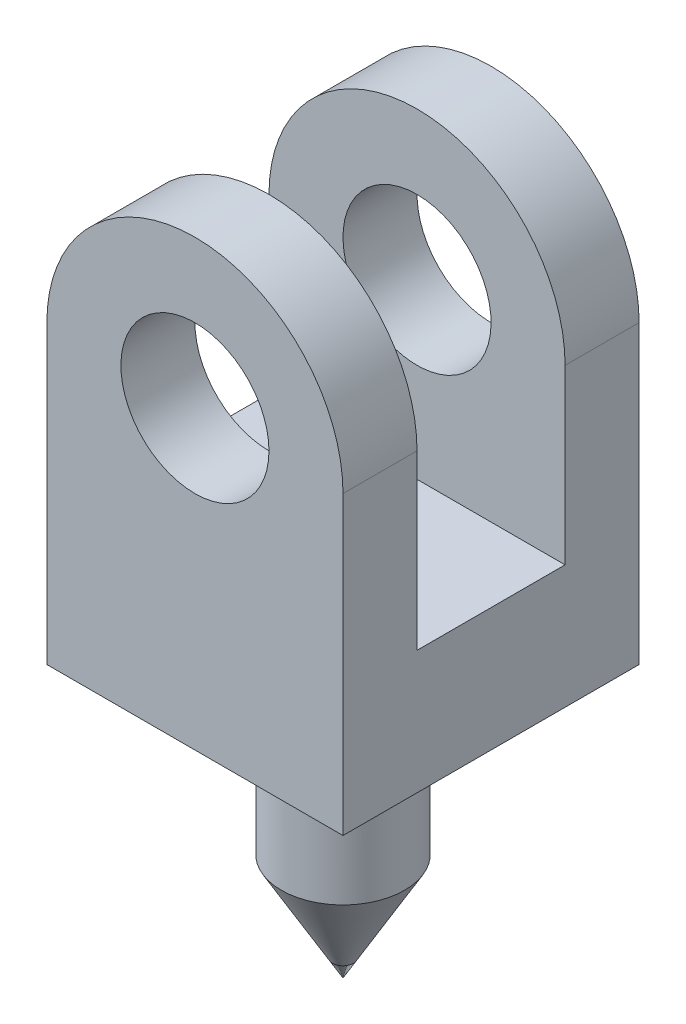
ISO-10303-21;
HEADER;
FILE_DESCRIPTION(('STEP AP214'),'2;1');
FILE_NAME('part.step','',(''),(''),'','','');
FILE_SCHEMA(('AUTOMOTIVE_DESIGN { 1 0 10303 214 1 1 1 1 }'));
ENDSEC;
DATA;
#1=APPLICATION_CONTEXT('core data for automotive mechanical design processes');
#2=APPLICATION_PROTOCOL_DEFINITION('international standard','automotive_design',2000,#1);
#3=PRODUCT_CONTEXT('',#1,'mechanical');
#4=PRODUCT('Part','Part','',(#3));
#5=PRODUCT_RELATED_PRODUCT_CATEGORY('part','',(#4));
#6=PRODUCT_DEFINITION_FORMATION('','',#4);
#7=PRODUCT_DEFINITION_CONTEXT('part definition',#1,'design');
#8=PRODUCT_DEFINITION('design','',#6,#7);
#9=PRODUCT_DEFINITION_SHAPE('','',#8);
#10=(LENGTH_UNIT() NAMED_UNIT(*) SI_UNIT(.MILLI.,.METRE.));
#11=(NAMED_UNIT(*) PLANE_ANGLE_UNIT() SI_UNIT($,.RADIAN.));
#12=(NAMED_UNIT(*) SI_UNIT($,.STERADIAN.) SOLID_ANGLE_UNIT());
#13=UNCERTAINTY_MEASURE_WITH_UNIT(LENGTH_MEASURE(1.E-05),#10,'distance_accuracy_value','');
#14=(GEOMETRIC_REPRESENTATION_CONTEXT(3) GLOBAL_UNCERTAINTY_ASSIGNED_CONTEXT((#13)) GLOBAL_UNIT_ASSIGNED_CONTEXT((#10,
#11,#12)) REPRESENTATION_CONTEXT('',''));
#15=CARTESIAN_POINT('',(0.,0.,0.));
#16=DIRECTION('',(0.,0.,1.));
#17=DIRECTION('',(1.,0.,0.));
#18=AXIS2_PLACEMENT_3D('',#15,#16,#17);
#19=CARTESIAN_POINT('',(0.,0.,12.));
#20=DIRECTION('',(0.,0.,-1.));
#21=DIRECTION('',(-1.,0.,0.));
#22=AXIS2_PLACEMENT_3D('',#19,#20,#21);
#23=CYLINDRICAL_SURFACE('',#22,12.);
#24=DIRECTION('',(0.,0.,-1.));
#25=VECTOR('',#24,1.);
#26=CARTESIAN_POINT('',(12.,0.,12.));
#27=LINE('',#26,#25);
#28=CARTESIAN_POINT('',(12.,0.,12.));
#29=VERTEX_POINT('',#28);
#30=CARTESIAN_POINT('',(12.,0.,6.));
#31=VERTEX_POINT('',#30);
#32=EDGE_CURVE('E156',#29,#31,#27,.T.);
#33=ORIENTED_EDGE('',*,*,#32,.T.);
#34=CARTESIAN_POINT('',(0.,0.,6.));
#35=DIRECTION('',(0.,0.,1.));
#36=DIRECTION('',(0.,-1.,0.));
#37=AXIS2_PLACEMENT_3D('',#34,#35,#36);
#38=CIRCLE('',#37,12.);
#39=CARTESIAN_POINT('',(-12.,0.,6.));
#40=VERTEX_POINT('',#39);
#41=EDGE_CURVE('E209',#31,#40,#38,.T.);
#42=ORIENTED_EDGE('',*,*,#41,.T.);
#43=DIRECTION('',(0.,0.,-1.));
#44=VECTOR('',#43,1.);
#45=CARTESIAN_POINT('',(-12.,0.,12.));
#46=LINE('',#45,#44);
#47=CARTESIAN_POINT('',(-12.,0.,12.));
#48=VERTEX_POINT('',#47);
#49=EDGE_CURVE('E12',#48,#40,#46,.T.);
#50=ORIENTED_EDGE('',*,*,#49,.F.);
#51=CARTESIAN_POINT('',(0.,0.,12.));
#52=DIRECTION('',(0.,0.,1.));
#53=DIRECTION('',(1.,0.,0.));
#54=AXIS2_PLACEMENT_3D('',#51,#52,#53);
#55=CIRCLE('',#54,12.);
#56=EDGE_CURVE('E144',#29,#48,#55,.T.);
#57=ORIENTED_EDGE('',*,*,#56,.F.);
#58=EDGE_LOOP('',(#33,#42,#50,#57));
#59=FACE_BOUND('',#58,.T.);
#60=ADVANCED_FACE('F65',(#59),#23,.T.);
#61=CARTESIAN_POINT('',(0.,0.,12.));
#62=DIRECTION('',(0.,0.,-1.));
#63=DIRECTION('',(-1.,0.,0.));
#64=AXIS2_PLACEMENT_3D('',#61,#62,#63);
#65=CYLINDRICAL_SURFACE('',#64,6.);
#66=CARTESIAN_POINT('',(0.,0.,6.));
#67=DIRECTION('',(0.,0.,1.));
#68=DIRECTION('',(0.,-1.,0.));
#69=AXIS2_PLACEMENT_3D('',#66,#67,#68);
#70=CIRCLE('',#69,6.);
#71=CARTESIAN_POINT('',(0.,-6.,6.));
#72=VERTEX_POINT('',#71);
#73=EDGE_CURVE('E69',#72,#72,#70,.T.);
#74=ORIENTED_EDGE('',*,*,#73,.F.);
#75=EDGE_LOOP('',(#74));
#76=FACE_BOUND('',#75,.T.);
#77=CARTESIAN_POINT('',(0.,0.,12.));
#78=DIRECTION('',(0.,0.,1.));
#79=DIRECTION('',(1.,0.,0.));
#80=AXIS2_PLACEMENT_3D('',#77,#78,#79);
#81=CIRCLE('',#80,6.);
#82=CARTESIAN_POINT('',(6.,0.,12.));
#83=VERTEX_POINT('',#82);
#84=EDGE_CURVE('E277',#83,#83,#81,.T.);
#85=ORIENTED_EDGE('',*,*,#84,.T.);
#86=EDGE_LOOP('',(#85));
#87=FACE_BOUND('',#86,.T.);
#88=ADVANCED_FACE('F361',(#76,#87),#65,.F.);
#89=CARTESIAN_POINT('',(0.,0.,12.));
#90=DIRECTION('',(0.,0.,1.));
#91=DIRECTION('',(1.,0.,0.));
#92=AXIS2_PLACEMENT_3D('',#89,#90,#91);
#93=PLANE('',#92);
#94=ORIENTED_EDGE('',*,*,#56,.T.);
#95=DIRECTION('',(0.,-1.,0.));
#96=VECTOR('',#95,1.);
#97=CARTESIAN_POINT('',(-12.,0.,12.));
#98=LINE('',#97,#96);
#99=CARTESIAN_POINT('',(-12.,-24.,12.));
#100=VERTEX_POINT('',#99);
#101=EDGE_CURVE('E126',#48,#100,#98,.T.);
#102=ORIENTED_EDGE('',*,*,#101,.T.);
#103=DIRECTION('',(1.,0.,0.));
#104=VECTOR('',#103,1.);
#105=CARTESIAN_POINT('',(0.,-24.,12.));
#106=LINE('',#105,#104);
#107=CARTESIAN_POINT('',(12.,-24.,12.));
#108=VERTEX_POINT('',#107);
#109=EDGE_CURVE('E115',#100,#108,#106,.T.);
#110=ORIENTED_EDGE('',*,*,#109,.T.);
#111=DIRECTION('',(0.,1.,0.));
#112=VECTOR('',#111,1.);
#113=CARTESIAN_POINT('',(12.,-24.,12.));
#114=LINE('',#113,#112);
#115=EDGE_CURVE('E91',#108,#29,#114,.T.);
#116=ORIENTED_EDGE('',*,*,#115,.T.);
#117=EDGE_LOOP('',(#94,#102,#110,#116));
#118=FACE_BOUND('',#117,.T.);
#119=ORIENTED_EDGE('',*,*,#84,.F.);
#120=EDGE_LOOP('',(#119));
#121=FACE_BOUND('',#120,.T.);
#122=ADVANCED_FACE('F141',(#118,#121),#93,.T.);
#123=CARTESIAN_POINT('',(0.,0.,-12.));
#124=DIRECTION('',(0.,0.,1.));
#125=DIRECTION('',(1.,0.,0.));
#126=AXIS2_PLACEMENT_3D('',#123,#124,#125);
#127=PLANE('',#126);
#128=CARTESIAN_POINT('',(0.,0.,-12.));
#129=DIRECTION('',(0.,0.,1.));
#130=DIRECTION('',(1.,0.,0.));
#131=AXIS2_PLACEMENT_3D('',#128,#129,#130);
#132=CIRCLE('',#131,12.);
#133=CARTESIAN_POINT('',(12.,0.,-12.));
#134=VERTEX_POINT('',#133);
#135=CARTESIAN_POINT('',(-12.,0.,-12.));
#136=VERTEX_POINT('',#135);
#137=EDGE_CURVE('E285',#134,#136,#132,.T.);
#138=ORIENTED_EDGE('',*,*,#137,.F.);
#139=DIRECTION('',(0.,1.,0.));
#140=VECTOR('',#139,1.);
#141=CARTESIAN_POINT('',(12.,-24.,-12.));
#142=LINE('',#141,#140);
#143=CARTESIAN_POINT('',(12.,-24.,-12.));
#144=VERTEX_POINT('',#143);
#145=EDGE_CURVE('E160',#144,#134,#142,.T.);
#146=ORIENTED_EDGE('',*,*,#145,.F.);
#147=DIRECTION('',(1.,0.,0.));
#148=VECTOR('',#147,1.);
#149=CARTESIAN_POINT('',(0.,-24.,-12.));
#150=LINE('',#149,#148);
#151=CARTESIAN_POINT('',(-12.,-24.,-12.));
#152=VERTEX_POINT('',#151);
#153=EDGE_CURVE('E162',#152,#144,#150,.T.);
#154=ORIENTED_EDGE('',*,*,#153,.F.);
#155=DIRECTION('',(0.,-1.,0.));
#156=VECTOR('',#155,1.);
#157=CARTESIAN_POINT('',(-12.,0.,-12.));
#158=LINE('',#157,#156);
#159=EDGE_CURVE('E151',#136,#152,#158,.T.);
#160=ORIENTED_EDGE('',*,*,#159,.F.);
#161=EDGE_LOOP('',(#138,#146,#154,#160));
#162=FACE_BOUND('',#161,.T.);
#163=CARTESIAN_POINT('',(0.,0.,-12.));
#164=DIRECTION('',(0.,0.,1.));
#165=DIRECTION('',(1.,0.,0.));
#166=AXIS2_PLACEMENT_3D('',#163,#164,#165);
#167=CIRCLE('',#166,6.);
#168=CARTESIAN_POINT('',(6.,0.,-12.));
#169=VERTEX_POINT('',#168);
#170=EDGE_CURVE('E137',#169,#169,#167,.T.);
#171=ORIENTED_EDGE('',*,*,#170,.T.);
#172=EDGE_LOOP('',(#171));
#173=FACE_BOUND('',#172,.T.);
#174=ADVANCED_FACE('F307',(#162,#173),#127,.F.);
#175=CARTESIAN_POINT('',(0.,0.,-6.));
#176=DIRECTION('',(0.,0.,-1.));
#177=DIRECTION('',(0.,1.,0.));
#178=AXIS2_PLACEMENT_3D('',#175,#176,#177);
#179=CIRCLE('',#178,12.);
#180=CARTESIAN_POINT('',(-12.,0.,-6.));
#181=VERTEX_POINT('',#180);
#182=CARTESIAN_POINT('',(12.,0.,-6.));
#183=VERTEX_POINT('',#182);
#184=EDGE_CURVE('E188',#181,#183,#179,.T.);
#185=ORIENTED_EDGE('',*,*,#184,.T.);
#186=EDGE_CURVE('E292',#183,#134,#27,.T.);
#187=ORIENTED_EDGE('',*,*,#186,.T.);
#188=ORIENTED_EDGE('',*,*,#137,.T.);
#189=EDGE_CURVE('E74',#181,#136,#46,.T.);
#190=ORIENTED_EDGE('',*,*,#189,.F.);
#191=EDGE_LOOP('',(#185,#187,#188,#190));
#192=FACE_BOUND('',#191,.T.);
#193=ADVANCED_FACE('F67',(#192),#23,.T.);
#194=CARTESIAN_POINT('',(-12.,0.,12.));
#195=DIRECTION('',(1.,0.,0.));
#196=DIRECTION('',(0.,0.,-1.));
#197=AXIS2_PLACEMENT_3D('',#194,#195,#196);
#198=PLANE('',#197);
#199=ORIENTED_EDGE('',*,*,#49,.T.);
#200=DIRECTION('',(0.,-1.,0.));
#201=VECTOR('',#200,1.);
#202=CARTESIAN_POINT('',(-12.,0.,6.));
#203=LINE('',#202,#201);
#204=CARTESIAN_POINT('',(-12.,-14.,6.));
#205=VERTEX_POINT('',#204);
#206=EDGE_CURVE('E206',#40,#205,#203,.T.);
#207=ORIENTED_EDGE('',*,*,#206,.T.);
#208=DIRECTION('',(0.,0.,-1.));
#209=VECTOR('',#208,1.);
#210=CARTESIAN_POINT('',(-12.,-14.,12.));
#211=LINE('',#210,#209);
#212=CARTESIAN_POINT('',(-12.,-14.,-6.));
#213=VERTEX_POINT('',#212);
#214=EDGE_CURVE('E212',#205,#213,#211,.T.);
#215=ORIENTED_EDGE('',*,*,#214,.T.);
#216=DIRECTION('',(0.,1.,0.));
#217=VECTOR('',#216,1.);
#218=CARTESIAN_POINT('',(-12.,0.,-6.));
#219=LINE('',#218,#217);
#220=EDGE_CURVE('E183',#213,#181,#219,.T.);
#221=ORIENTED_EDGE('',*,*,#220,.T.);
#222=ORIENTED_EDGE('',*,*,#189,.T.);
#223=ORIENTED_EDGE('',*,*,#159,.T.);
#224=DIRECTION('',(0.,0.,-1.));
#225=VECTOR('',#224,1.);
#226=CARTESIAN_POINT('',(-12.,-24.,12.));
#227=LINE('',#226,#225);
#228=EDGE_CURVE('E132',#100,#152,#227,.T.);
#229=ORIENTED_EDGE('',*,*,#228,.F.);
#230=ORIENTED_EDGE('',*,*,#101,.F.);
#231=EDGE_LOOP('',(#199,#207,#215,#221,#222,#223,#229,#230));
#232=FACE_BOUND('',#231,.T.);
#233=ADVANCED_FACE('F149',(#232),#198,.F.);
#234=CARTESIAN_POINT('',(12.,-24.,12.));
#235=DIRECTION('',(-1.,0.,0.));
#236=DIRECTION('',(0.,0.,1.));
#237=AXIS2_PLACEMENT_3D('',#234,#235,#236);
#238=PLANE('',#237);
#239=DIRECTION('',(0.,0.,-1.));
#240=VECTOR('',#239,1.);
#241=CARTESIAN_POINT('',(12.,-14.,6.));
#242=LINE('',#241,#240);
#243=CARTESIAN_POINT('',(12.,-14.,6.));
#244=VERTEX_POINT('',#243);
#245=CARTESIAN_POINT('',(12.,-14.,-6.));
#246=VERTEX_POINT('',#245);
#247=EDGE_CURVE('E383',#244,#246,#242,.T.);
#248=ORIENTED_EDGE('',*,*,#247,.F.);
#249=DIRECTION('',(0.,-1.,0.));
#250=VECTOR('',#249,1.);
#251=CARTESIAN_POINT('',(12.,12.,6.));
#252=LINE('',#251,#250);
#253=EDGE_CURVE('E82',#31,#244,#252,.T.);
#254=ORIENTED_EDGE('',*,*,#253,.F.);
#255=ORIENTED_EDGE('',*,*,#32,.F.);
#256=ORIENTED_EDGE('',*,*,#115,.F.);
#257=DIRECTION('',(0.,0.,1.));
#258=VECTOR('',#257,1.);
#259=CARTESIAN_POINT('',(12.,-24.,12.));
#260=LINE('',#259,#258);
#261=EDGE_CURVE('E153',#108,#144,#260,.F.);
#262=ORIENTED_EDGE('',*,*,#261,.T.);
#263=ORIENTED_EDGE('',*,*,#145,.T.);
#264=ORIENTED_EDGE('',*,*,#186,.F.);
#265=DIRECTION('',(0.,1.,0.));
#266=VECTOR('',#265,1.);
#267=CARTESIAN_POINT('',(12.,12.,-6.));
#268=LINE('',#267,#266);
#269=EDGE_CURVE('E199',#246,#183,#268,.T.);
#270=ORIENTED_EDGE('',*,*,#269,.F.);
#271=EDGE_LOOP('',(#248,#254,#255,#256,#262,#263,#264,#270));
#272=FACE_BOUND('',#271,.T.);
#273=ADVANCED_FACE('F305',(#272),#238,.F.);
#274=CARTESIAN_POINT('',(0.,0.,-6.));
#275=DIRECTION('',(0.,0.,-1.));
#276=DIRECTION('',(0.,1.,0.));
#277=AXIS2_PLACEMENT_3D('',#274,#275,#276);
#278=CIRCLE('',#277,6.);
#279=CARTESIAN_POINT('',(0.,6.,-6.));
#280=VERTEX_POINT('',#279);
#281=EDGE_CURVE('E181',#280,#280,#278,.T.);
#282=ORIENTED_EDGE('',*,*,#281,.F.);
#283=EDGE_LOOP('',(#282));
#284=FACE_BOUND('',#283,.T.);
#285=ORIENTED_EDGE('',*,*,#170,.F.);
#286=EDGE_LOOP('',(#285));
#287=FACE_BOUND('',#286,.T.);
#288=ADVANCED_FACE('F246',(#284,#287),#65,.F.);
#289=CARTESIAN_POINT('',(3.53553390593274,-31.,3.53553390593274));
#290=CARTESIAN_POINT('',(12.,-24.,12.));
#291=CARTESIAN_POINT('',(3.9522005725994,-31.,3.11886723926607));
#292=CARTESIAN_POINT('',(12.,-24.,10.));
#293=CARTESIAN_POINT('',(4.32579298105229,-31.,2.59339721214962));
#294=CARTESIAN_POINT('',(12.,-24.,8.));
#295=CARTESIAN_POINT('',(4.72016759446828,-31.,1.68213150016822));
#296=CARTESIAN_POINT('',(12.,-24.,4.99999999999999));
#297=CARTESIAN_POINT('',(4.82392482457469,-31.,1.35881651527707));
#298=CARTESIAN_POINT('',(12.,-24.,3.99999999999999));
#299=CARTESIAN_POINT('',(4.96388446697993,-31.,0.690278229276499));
#300=CARTESIAN_POINT('',(12.,-24.,1.99999999999999));
#301=CARTESIAN_POINT('',(5.,-31.,0.345177968644247));
#302=CARTESIAN_POINT('',(12.,-24.,0.999999999999994));
#303=CARTESIAN_POINT('',(5.,-31.,-0.345177968644245));
#304=CARTESIAN_POINT('',(12.,-24.,-1.00000000000001));
#305=CARTESIAN_POINT('',(4.96388446697993,-31.,-0.690278229276497));
#306=CARTESIAN_POINT('',(12.,-24.,-2.00000000000001));
#307=CARTESIAN_POINT('',(4.82392482457469,-31.,-1.35881651527707));
#308=CARTESIAN_POINT('',(12.,-24.,-4.00000000000001));
#309=CARTESIAN_POINT('',(4.72016759446828,-31.,-1.68213150016822));
#310=CARTESIAN_POINT('',(12.,-24.,-5.00000000000001));
#311=CARTESIAN_POINT('',(4.32579298105229,-31.,-2.59339721214962));
#312=CARTESIAN_POINT('',(12.,-24.,-8.00000000000001));
#313=CARTESIAN_POINT('',(3.95220057259941,-31.,-3.11886723926607));
#314=CARTESIAN_POINT('',(12.,-24.,-10.));
#315=CARTESIAN_POINT('',(3.53553390593274,-31.,-3.53553390593274));
#316=CARTESIAN_POINT('',(12.,-24.,-12.));
#317=B_SPLINE_SURFACE_WITH_KNOTS('',3,1,((#289,#290),(#291,#292),(#293,#294),(#295,#296),(#297,
#298),(#299,#300),(#301,#302),(#303,#304),(#305,#306),(#307,#308),(#309,#310),(#311,#312),(#313,
#314),(#315,#316)),.UNSPECIFIED.,.F.,.F.,.F.,(4,2,2,2,2,2,4),(2,2),(0.,0.25,0.375,0.5,0.625,
0.75,1.),(0.,1.),.UNSPECIFIED.);
#318=CARTESIAN_POINT('',(0.,-31.,0.));
#319=DIRECTION('',(0.,1.,0.));
#320=DIRECTION('',(0.,0.,1.));
#321=AXIS2_PLACEMENT_3D('',#318,#319,#320);
#322=CIRCLE('',#321,5.);
#323=CARTESIAN_POINT('',(3.53553390593274,-31.,3.53553390593274));
#324=VERTEX_POINT('',#323);
#325=CARTESIAN_POINT('',(3.53553390593274,-31.,-3.53553390593274));
#326=VERTEX_POINT('',#325);
#327=EDGE_CURVE('E167',#324,#326,#322,.T.);
#328=DIRECTION('',(0.610402469926739,0.504794660643982,-0.610402469926739));
#329=VECTOR('',#328,1.);
#330=CARTESIAN_POINT('',(7.76776695296637,-27.5,-7.76776695296637));
#331=LINE('',#330,#329);
#332=EDGE_CURVE('E311',#326,#144,#331,.T.);
#333=DIRECTION('',(-0.610402469926739,-0.504794660643982,-0.610402469926739));
#334=VECTOR('',#333,1.);
#335=CARTESIAN_POINT('',(7.76776695296637,-27.5,7.76776695296637));
#336=LINE('',#335,#334);
#337=EDGE_CURVE('E123',#108,#324,#336,.T.);
#338=ORIENTED_EDGE('',*,*,#327,.T.);
#339=ORIENTED_EDGE('',*,*,#332,.T.);
#340=ORIENTED_EDGE('',*,*,#261,.F.);
#341=ORIENTED_EDGE('',*,*,#337,.T.);
#342=EDGE_LOOP('',(#338,#339,#340,#341));
#343=FACE_BOUND('',#342,.T.);
#344=ADVANCED_FACE('F239',(#343),#317,.T.);
#345=CARTESIAN_POINT('',(3.53553390593274,-31.,-3.53553390593274));
#346=CARTESIAN_POINT('',(12.,-24.,-12.));
#347=CARTESIAN_POINT('',(3.11886723926607,-31.,-3.9522005725994));
#348=CARTESIAN_POINT('',(9.99999999999999,-24.,-12.));
#349=CARTESIAN_POINT('',(2.59339721214962,-31.,-4.32579298105229));
#350=CARTESIAN_POINT('',(7.99999999999999,-24.,-12.));
#351=CARTESIAN_POINT('',(1.68213150016822,-31.,-4.72016759446828));
#352=CARTESIAN_POINT('',(4.99999999999999,-24.,-12.));
#353=CARTESIAN_POINT('',(1.35881651527707,-31.,-4.82392482457469));
#354=CARTESIAN_POINT('',(3.99999999999999,-24.,-12.));
#355=CARTESIAN_POINT('',(0.690278229276499,-31.,-4.96388446697993));
#356=CARTESIAN_POINT('',(1.99999999999999,-24.,-12.));
#357=CARTESIAN_POINT('',(0.345177968644246,-31.,-5.));
#358=CARTESIAN_POINT('',(0.99999999999999,-24.,-12.));
#359=CARTESIAN_POINT('',(-0.345177968644245,-31.,-5.));
#360=CARTESIAN_POINT('',(-1.00000000000001,-24.,-12.));
#361=CARTESIAN_POINT('',(-0.690278229276498,-31.,-4.96388446697993));
#362=CARTESIAN_POINT('',(-2.00000000000001,-24.,-12.));
#363=CARTESIAN_POINT('',(-1.35881651527707,-31.,-4.82392482457469));
#364=CARTESIAN_POINT('',(-4.,-24.,-12.));
#365=CARTESIAN_POINT('',(-1.68213150016822,-31.,-4.72016759446828));
#366=CARTESIAN_POINT('',(-5.,-24.,-12.));
#367=CARTESIAN_POINT('',(-2.59339721214962,-31.,-4.32579298105229));
#368=CARTESIAN_POINT('',(-8.,-24.,-12.));
#369=CARTESIAN_POINT('',(-3.11886723926607,-31.,-3.95220057259941));
#370=CARTESIAN_POINT('',(-10.,-24.,-12.));
#371=CARTESIAN_POINT('',(-3.53553390593274,-31.,-3.53553390593274));
#372=CARTESIAN_POINT('',(-12.,-24.,-12.));
#373=B_SPLINE_SURFACE_WITH_KNOTS('',3,1,((#345,#346),(#347,#348),(#349,#350),(#351,#352),(#353,
#354),(#355,#356),(#357,#358),(#359,#360),(#361,#362),(#363,#364),(#365,#366),(#367,#368),(#369,
#370),(#371,#372)),.UNSPECIFIED.,.F.,.F.,.F.,(4,2,2,2,2,2,4),(2,2),(0.,0.25,0.375,0.5,0.625,
0.75,1.),(0.,1.),.UNSPECIFIED.);
#374=CARTESIAN_POINT('',(-3.53553390593274,-31.,-3.53553390593274));
#375=VERTEX_POINT('',#374);
#376=EDGE_CURVE('E177',#326,#375,#322,.T.);
#377=DIRECTION('',(-0.610402469926739,0.504794660643982,-0.610402469926739));
#378=VECTOR('',#377,1.);
#379=CARTESIAN_POINT('',(-7.76776695296637,-27.5,-7.76776695296637));
#380=LINE('',#379,#378);
#381=EDGE_CURVE('E138',#375,#152,#380,.T.);
#382=ORIENTED_EDGE('',*,*,#376,.T.);
#383=ORIENTED_EDGE('',*,*,#381,.T.);
#384=ORIENTED_EDGE('',*,*,#153,.T.);
#385=ORIENTED_EDGE('',*,*,#332,.F.);
#386=EDGE_LOOP('',(#382,#383,#384,#385));
#387=FACE_BOUND('',#386,.T.);
#388=ADVANCED_FACE('F245',(#387),#373,.T.);
#389=CARTESIAN_POINT('',(-3.53553390593274,-31.,3.53553390593274));
#390=CARTESIAN_POINT('',(-12.,-24.,12.));
#391=CARTESIAN_POINT('',(-3.11886723926607,-31.,3.9522005725994));
#392=CARTESIAN_POINT('',(-9.99999999999999,-24.,12.));
#393=CARTESIAN_POINT('',(-2.59339721214962,-31.,4.32579298105229));
#394=CARTESIAN_POINT('',(-7.99999999999999,-24.,12.));
#395=CARTESIAN_POINT('',(-1.68213150016822,-31.,4.72016759446828));
#396=CARTESIAN_POINT('',(-4.99999999999999,-24.,12.));
#397=CARTESIAN_POINT('',(-1.35881651527707,-31.,4.82392482457469));
#398=CARTESIAN_POINT('',(-3.99999999999999,-24.,12.));
#399=CARTESIAN_POINT('',(-0.690278229276499,-31.,4.96388446697993));
#400=CARTESIAN_POINT('',(-1.99999999999999,-24.,12.));
#401=CARTESIAN_POINT('',(-0.345177968644247,-31.,5.));
#402=CARTESIAN_POINT('',(-0.99999999999999,-24.,12.));
#403=CARTESIAN_POINT('',(0.345177968644246,-31.,5.));
#404=CARTESIAN_POINT('',(1.00000000000001,-24.,12.));
#405=CARTESIAN_POINT('',(0.690278229276498,-31.,4.96388446697993));
#406=CARTESIAN_POINT('',(2.00000000000001,-24.,12.));
#407=CARTESIAN_POINT('',(1.35881651527707,-31.,4.82392482457469));
#408=CARTESIAN_POINT('',(4.,-24.,12.));
#409=CARTESIAN_POINT('',(1.68213150016822,-31.,4.72016759446828));
#410=CARTESIAN_POINT('',(5.,-24.,12.));
#411=CARTESIAN_POINT('',(2.59339721214962,-31.,4.32579298105229));
#412=CARTESIAN_POINT('',(8.,-24.,12.));
#413=CARTESIAN_POINT('',(3.11886723926607,-31.,3.95220057259941));
#414=CARTESIAN_POINT('',(10.,-24.,12.));
#415=CARTESIAN_POINT('',(3.53553390593274,-31.,3.53553390593274));
#416=CARTESIAN_POINT('',(12.,-24.,12.));
#417=B_SPLINE_SURFACE_WITH_KNOTS('',3,1,((#389,#390),(#391,#392),(#393,#394),(#395,#396),(#397,
#398),(#399,#400),(#401,#402),(#403,#404),(#405,#406),(#407,#408),(#409,#410),(#411,#412),(#413,
#414),(#415,#416)),.UNSPECIFIED.,.F.,.F.,.F.,(4,2,2,2,2,2,4),(2,2),(0.,0.25,0.375,0.5,0.625,
0.75,1.),(0.,1.),.UNSPECIFIED.);
#418=CARTESIAN_POINT('',(-3.53553390593274,-31.,3.53553390593274));
#419=VERTEX_POINT('',#418);
#420=EDGE_CURVE('E164',#419,#324,#322,.T.);
#421=DIRECTION('',(-0.610402469926739,0.504794660643982,0.610402469926739));
#422=VECTOR('',#421,1.);
#423=CARTESIAN_POINT('',(-7.76776695296637,-27.5,7.76776695296637));
#424=LINE('',#423,#422);
#425=EDGE_CURVE('E120',#419,#100,#424,.T.);
#426=ORIENTED_EDGE('',*,*,#420,.T.);
#427=ORIENTED_EDGE('',*,*,#337,.F.);
#428=ORIENTED_EDGE('',*,*,#109,.F.);
#429=ORIENTED_EDGE('',*,*,#425,.F.);
#430=EDGE_LOOP('',(#426,#427,#428,#429));
#431=FACE_BOUND('',#430,.T.);
#432=ADVANCED_FACE('F118',(#431),#417,.T.);
#433=CARTESIAN_POINT('',(-3.53553390593274,-31.,-3.53553390593274));
#434=CARTESIAN_POINT('',(-12.,-24.,-12.));
#435=CARTESIAN_POINT('',(-3.9522005725994,-31.,-3.11886723926607));
#436=CARTESIAN_POINT('',(-12.,-24.,-10.));
#437=CARTESIAN_POINT('',(-4.32579298105229,-31.,-2.59339721214962));
#438=CARTESIAN_POINT('',(-12.,-24.,-8.));
#439=CARTESIAN_POINT('',(-4.72016759446828,-31.,-1.68213150016822));
#440=CARTESIAN_POINT('',(-12.,-24.,-5.));
#441=CARTESIAN_POINT('',(-4.82392482457469,-31.,-1.35881651527707));
#442=CARTESIAN_POINT('',(-12.,-24.,-3.99999999999999));
#443=CARTESIAN_POINT('',(-4.96388446697993,-31.,-0.690278229276499));
#444=CARTESIAN_POINT('',(-12.,-24.,-1.99999999999999));
#445=CARTESIAN_POINT('',(-5.,-31.,-0.345177968644247));
#446=CARTESIAN_POINT('',(-12.,-24.,-0.999999999999995));
#447=CARTESIAN_POINT('',(-5.,-31.,0.345177968644245));
#448=CARTESIAN_POINT('',(-12.,-24.,1.00000000000001));
#449=CARTESIAN_POINT('',(-4.96388446697993,-31.,0.690278229276497));
#450=CARTESIAN_POINT('',(-12.,-24.,2.00000000000001));
#451=CARTESIAN_POINT('',(-4.82392482457469,-31.,1.35881651527707));
#452=CARTESIAN_POINT('',(-12.,-24.,4.));
#453=CARTESIAN_POINT('',(-4.72016759446828,-31.,1.68213150016822));
#454=CARTESIAN_POINT('',(-12.,-24.,5.));
#455=CARTESIAN_POINT('',(-4.32579298105229,-31.,2.59339721214962));
#456=CARTESIAN_POINT('',(-12.,-24.,8.));
#457=CARTESIAN_POINT('',(-3.9522005725994,-31.,3.11886723926607));
#458=CARTESIAN_POINT('',(-12.,-24.,10.));
#459=CARTESIAN_POINT('',(-3.53553390593274,-31.,3.53553390593274));
#460=CARTESIAN_POINT('',(-12.,-24.,12.));
#461=B_SPLINE_SURFACE_WITH_KNOTS('',3,1,((#433,#434),(#435,#436),(#437,#438),(#439,#440),(#441,
#442),(#443,#444),(#445,#446),(#447,#448),(#449,#450),(#451,#452),(#453,#454),(#455,#456),(#457,
#458),(#459,#460)),.UNSPECIFIED.,.F.,.F.,.F.,(4,2,2,2,2,2,4),(2,2),(0.,0.25,0.375,0.5,0.625,
0.75,1.),(0.,1.),.UNSPECIFIED.);
#462=EDGE_CURVE('E135',#375,#419,#322,.T.);
#463=ORIENTED_EDGE('',*,*,#462,.T.);
#464=ORIENTED_EDGE('',*,*,#425,.T.);
#465=ORIENTED_EDGE('',*,*,#228,.T.);
#466=ORIENTED_EDGE('',*,*,#381,.F.);
#467=EDGE_LOOP('',(#463,#464,#465,#466));
#468=FACE_BOUND('',#467,.T.);
#469=ADVANCED_FACE('F129',(#468),#461,.T.);
#470=CARTESIAN_POINT('',(0.,-46.,0.));
#471=DIRECTION('',(0.,-1.,0.));
#472=DIRECTION('',(1.,0.,0.));
#473=AXIS2_PLACEMENT_3D('',#470,#471,#472);
#474=CYLINDRICAL_SURFACE('',#473,5.);
#475=CARTESIAN_POINT('',(0.,-37.3397459621555,0.));
#476=DIRECTION('',(0.,-1.,0.));
#477=DIRECTION('',(1.,0.,0.));
#478=AXIS2_PLACEMENT_3D('',#475,#476,#477);
#479=CIRCLE('',#478,5.);
#480=CARTESIAN_POINT('',(5.,-37.3397459621555,0.));
#481=VERTEX_POINT('',#480);
#482=EDGE_CURVE('E215',#481,#481,#479,.T.);
#483=ORIENTED_EDGE('',*,*,#482,.F.);
#484=EDGE_LOOP('',(#483));
#485=FACE_BOUND('',#484,.T.);
#486=ORIENTED_EDGE('',*,*,#420,.F.);
#487=ORIENTED_EDGE('',*,*,#462,.F.);
#488=ORIENTED_EDGE('',*,*,#376,.F.);
#489=ORIENTED_EDGE('',*,*,#327,.F.);
#490=EDGE_LOOP('',(#486,#487,#488,#489));
#491=FACE_BOUND('',#490,.T.);
#492=ADVANCED_FACE('F226',(#485,#491),#474,.T.);
#493=CARTESIAN_POINT('',(0.,-37.3397459621555,0.));
#494=DIRECTION('',(0.,1.,0.));
#495=DIRECTION('',(-1.,0.,0.));
#496=AXIS2_PLACEMENT_3D('',#493,#494,#495);
#497=CONICAL_SURFACE('',#496,5.,0.523598775598293);
#498=CARTESIAN_POINT('',(0.,-46.,0.));
#499=VERTEX_POINT('',#498);
#500=VERTEX_LOOP('',#499);
#501=FACE_BOUND('',#500,.T.);
#502=ORIENTED_EDGE('',*,*,#482,.T.);
#503=EDGE_LOOP('',(#502));
#504=FACE_BOUND('',#503,.T.);
#505=ADVANCED_FACE('F236',(#501,#504),#497,.T.);
#506=CARTESIAN_POINT('',(-12.000025,-14.,6.));
#507=DIRECTION('',(0.,-1.,0.));
#508=DIRECTION('',(0.,0.,-1.));
#509=AXIS2_PLACEMENT_3D('',#506,#507,#508);
#510=PLANE('',#509);
#511=DIRECTION('',(1.,0.,0.));
#512=VECTOR('',#511,1.);
#513=CARTESIAN_POINT('',(-12.000025,-14.,6.));
#514=LINE('',#513,#512);
#515=EDGE_CURVE('E191',#205,#244,#514,.T.);
#516=ORIENTED_EDGE('',*,*,#515,.T.);
#517=ORIENTED_EDGE('',*,*,#247,.T.);
#518=DIRECTION('',(1.,0.,0.));
#519=VECTOR('',#518,1.);
#520=CARTESIAN_POINT('',(-12.000025,-14.,-6.));
#521=LINE('',#520,#519);
#522=EDGE_CURVE('E184',#213,#246,#521,.T.);
#523=ORIENTED_EDGE('',*,*,#522,.F.);
#524=ORIENTED_EDGE('',*,*,#214,.F.);
#525=EDGE_LOOP('',(#516,#517,#523,#524));
#526=FACE_BOUND('',#525,.T.);
#527=ADVANCED_FACE('F404',(#526),#510,.F.);
#528=CARTESIAN_POINT('',(-12.000025,12.,6.));
#529=DIRECTION('',(0.,0.,1.));
#530=DIRECTION('',(0.,-1.,0.));
#531=AXIS2_PLACEMENT_3D('',#528,#529,#530);
#532=PLANE('',#531);
#533=ORIENTED_EDGE('',*,*,#73,.T.);
#534=EDGE_LOOP('',(#533));
#535=FACE_BOUND('',#534,.T.);
#536=ORIENTED_EDGE('',*,*,#253,.T.);
#537=ORIENTED_EDGE('',*,*,#515,.F.);
#538=ORIENTED_EDGE('',*,*,#206,.F.);
#539=ORIENTED_EDGE('',*,*,#41,.F.);
#540=EDGE_LOOP('',(#536,#537,#538,#539));
#541=FACE_BOUND('',#540,.T.);
#542=ADVANCED_FACE('F409',(#535,#541),#532,.F.);
#543=CARTESIAN_POINT('',(-12.000025,12.,-6.));
#544=DIRECTION('',(0.,0.,-1.));
#545=DIRECTION('',(0.,1.,0.));
#546=AXIS2_PLACEMENT_3D('',#543,#544,#545);
#547=PLANE('',#546);
#548=ORIENTED_EDGE('',*,*,#281,.T.);
#549=EDGE_LOOP('',(#548));
#550=FACE_BOUND('',#549,.T.);
#551=ORIENTED_EDGE('',*,*,#184,.F.);
#552=ORIENTED_EDGE('',*,*,#220,.F.);
#553=ORIENTED_EDGE('',*,*,#522,.T.);
#554=ORIENTED_EDGE('',*,*,#269,.T.);
#555=EDGE_LOOP('',(#551,#552,#553,#554));
#556=FACE_BOUND('',#555,.T.);
#557=ADVANCED_FACE('F386',(#550,#556),#547,.F.);
#558=CLOSED_SHELL('',(#60,#88,#122,#174,#193,#233,#273,#288,#344,#388,#432,#469,#492,#505,#527,
#542,#557));
#559=MANIFOLD_SOLID_BREP('B2',#558);
#560=ADVANCED_BREP_SHAPE_REPRESENTATION('',(#18,#559),#14);
#561=SHAPE_DEFINITION_REPRESENTATION(#9,#560);
ENDSEC;
END-ISO-10303-21;
